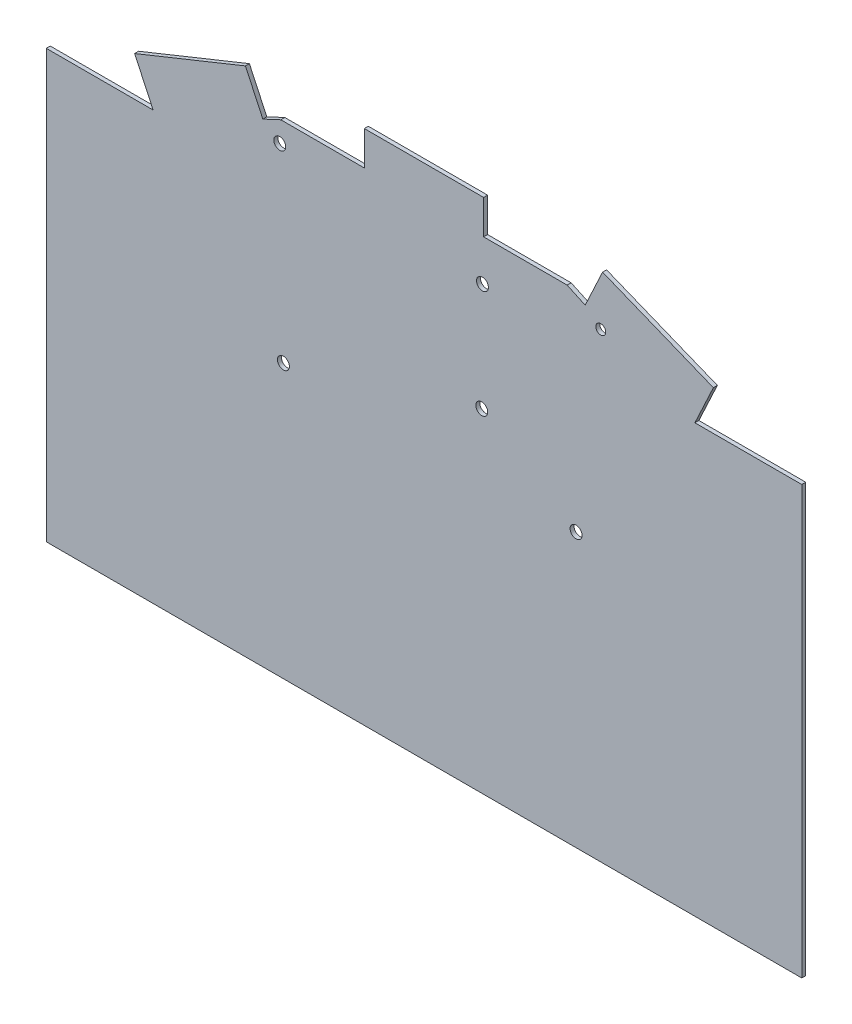
ISO-10303-21;
HEADER;
FILE_DESCRIPTION(('STEP AP214'),'2;1');
FILE_NAME('part.step','',(''),(''),'','','');
FILE_SCHEMA(('AUTOMOTIVE_DESIGN { 1 0 10303 214 1 1 1 1 }'));
ENDSEC;
DATA;
#1=APPLICATION_CONTEXT('core data for automotive mechanical design processes');
#2=APPLICATION_PROTOCOL_DEFINITION('international standard','automotive_design',2000,#1);
#3=PRODUCT_CONTEXT('',#1,'mechanical');
#4=PRODUCT('Part','Part','',(#3));
#5=PRODUCT_RELATED_PRODUCT_CATEGORY('part','',(#4));
#6=PRODUCT_DEFINITION_FORMATION('','',#4);
#7=PRODUCT_DEFINITION_CONTEXT('part definition',#1,'design');
#8=PRODUCT_DEFINITION('design','',#6,#7);
#9=PRODUCT_DEFINITION_SHAPE('','',#8);
#10=(LENGTH_UNIT() NAMED_UNIT(*) SI_UNIT(.MILLI.,.METRE.));
#11=(NAMED_UNIT(*) PLANE_ANGLE_UNIT() SI_UNIT($,.RADIAN.));
#12=(NAMED_UNIT(*) SI_UNIT($,.STERADIAN.) SOLID_ANGLE_UNIT());
#13=UNCERTAINTY_MEASURE_WITH_UNIT(LENGTH_MEASURE(1.E-05),#10,'distance_accuracy_value','');
#14=(GEOMETRIC_REPRESENTATION_CONTEXT(3) GLOBAL_UNCERTAINTY_ASSIGNED_CONTEXT((#13)) GLOBAL_UNIT_ASSIGNED_CONTEXT((#10,
#11,#12)) REPRESENTATION_CONTEXT('',''));
#15=CARTESIAN_POINT('',(0.,0.,0.));
#16=DIRECTION('',(0.,0.,1.));
#17=DIRECTION('',(1.,0.,0.));
#18=AXIS2_PLACEMENT_3D('',#15,#16,#17);
#19=CARTESIAN_POINT('',(-95.,-65.,1.));
#20=DIRECTION('',(-1.,0.,0.));
#21=DIRECTION('',(0.,0.,1.));
#22=AXIS2_PLACEMENT_3D('',#19,#20,#21);
#23=PLANE('',#22);
#24=DIRECTION('',(0.,0.,-1.));
#25=VECTOR('',#24,1.);
#26=CARTESIAN_POINT('',(-95.,42.4822262867314,1.001));
#27=LINE('',#26,#25);
#28=CARTESIAN_POINT('',(-95.,42.4822262867314,1.));
#29=VERTEX_POINT('',#28);
#30=CARTESIAN_POINT('',(-95.,42.4822262867314,0.));
#31=VERTEX_POINT('',#30);
#32=EDGE_CURVE('E194',#29,#31,#27,.T.);
#33=ORIENTED_EDGE('',*,*,#32,.T.);
#34=DIRECTION('',(0.,1.,0.));
#35=VECTOR('',#34,1.);
#36=CARTESIAN_POINT('',(-95.,-65.,0.));
#37=LINE('',#36,#35);
#38=CARTESIAN_POINT('',(-95.,-65.,0.));
#39=VERTEX_POINT('',#38);
#40=EDGE_CURVE('E234',#39,#31,#37,.T.);
#41=ORIENTED_EDGE('',*,*,#40,.F.);
#42=DIRECTION('',(0.,0.,-1.));
#43=VECTOR('',#42,1.);
#44=CARTESIAN_POINT('',(-95.,-65.,1.));
#45=LINE('',#44,#43);
#46=CARTESIAN_POINT('',(-95.,-65.,1.));
#47=VERTEX_POINT('',#46);
#48=EDGE_CURVE('E11',#47,#39,#45,.T.);
#49=ORIENTED_EDGE('',*,*,#48,.F.);
#50=DIRECTION('',(0.,1.,0.));
#51=VECTOR('',#50,1.);
#52=CARTESIAN_POINT('',(-95.,-65.,1.));
#53=LINE('',#52,#51);
#54=EDGE_CURVE('E235',#47,#29,#53,.T.);
#55=ORIENTED_EDGE('',*,*,#54,.T.);
#56=EDGE_LOOP('',(#33,#41,#49,#55));
#57=FACE_BOUND('',#56,.T.);
#58=ADVANCED_FACE('F37',(#57),#23,.T.);
#59=CARTESIAN_POINT('',(-95.,-65.,1.));
#60=DIRECTION('',(0.,1.,0.));
#61=DIRECTION('',(0.,0.,1.));
#62=AXIS2_PLACEMENT_3D('',#59,#60,#61);
#63=PLANE('',#62);
#64=DIRECTION('',(1.,0.,0.));
#65=VECTOR('',#64,1.);
#66=CARTESIAN_POINT('',(-95.,-65.,0.));
#67=LINE('',#66,#65);
#68=CARTESIAN_POINT('',(95.,-65.,0.));
#69=VERTEX_POINT('',#68);
#70=EDGE_CURVE('E239',#39,#69,#67,.T.);
#71=ORIENTED_EDGE('',*,*,#70,.T.);
#72=DIRECTION('',(0.,0.,-1.));
#73=VECTOR('',#72,1.);
#74=CARTESIAN_POINT('',(95.,-65.,1.));
#75=LINE('',#74,#73);
#76=CARTESIAN_POINT('',(95.,-65.,1.));
#77=VERTEX_POINT('',#76);
#78=EDGE_CURVE('E40',#77,#69,#75,.T.);
#79=ORIENTED_EDGE('',*,*,#78,.F.);
#80=DIRECTION('',(1.,0.,0.));
#81=VECTOR('',#80,1.);
#82=CARTESIAN_POINT('',(-95.,-65.,1.));
#83=LINE('',#82,#81);
#84=EDGE_CURVE('E244',#47,#77,#83,.T.);
#85=ORIENTED_EDGE('',*,*,#84,.F.);
#86=ORIENTED_EDGE('',*,*,#48,.T.);
#87=EDGE_LOOP('',(#71,#79,#85,#86));
#88=FACE_BOUND('',#87,.T.);
#89=ADVANCED_FACE('F258',(#88),#63,.F.);
#90=CARTESIAN_POINT('',(95.,-65.,1.));
#91=DIRECTION('',(-1.,0.,0.));
#92=DIRECTION('',(0.,0.,1.));
#93=AXIS2_PLACEMENT_3D('',#90,#91,#92);
#94=PLANE('',#93);
#95=DIRECTION('',(0.,1.,0.));
#96=VECTOR('',#95,1.);
#97=CARTESIAN_POINT('',(95.,-65.,0.));
#98=LINE('',#97,#96);
#99=CARTESIAN_POINT('',(95.,42.4822262867326,0.));
#100=VERTEX_POINT('',#99);
#101=EDGE_CURVE('E251',#69,#100,#98,.T.);
#102=ORIENTED_EDGE('',*,*,#101,.T.);
#103=DIRECTION('',(0.,0.,-1.));
#104=VECTOR('',#103,1.);
#105=CARTESIAN_POINT('',(95.,42.4822262867326,1.001));
#106=LINE('',#105,#104);
#107=CARTESIAN_POINT('',(95.,42.4822262867326,1.));
#108=VERTEX_POINT('',#107);
#109=EDGE_CURVE('E275',#108,#100,#106,.T.);
#110=ORIENTED_EDGE('',*,*,#109,.F.);
#111=DIRECTION('',(0.,1.,0.));
#112=VECTOR('',#111,1.);
#113=CARTESIAN_POINT('',(95.,-65.,1.));
#114=LINE('',#113,#112);
#115=EDGE_CURVE('E242',#77,#108,#114,.T.);
#116=ORIENTED_EDGE('',*,*,#115,.F.);
#117=ORIENTED_EDGE('',*,*,#78,.T.);
#118=EDGE_LOOP('',(#102,#110,#116,#117));
#119=FACE_BOUND('',#118,.T.);
#120=ADVANCED_FACE('F265',(#119),#94,.F.);
#121=CARTESIAN_POINT('',(-95.,65.,1.));
#122=DIRECTION('',(0.,1.,0.));
#123=DIRECTION('',(0.,0.,1.));
#124=AXIS2_PLACEMENT_3D('',#121,#122,#123);
#125=PLANE('',#124);
#126=DIRECTION('',(0.,0.,-1.));
#127=VECTOR('',#126,1.);
#128=CARTESIAN_POINT('',(15.0000000000007,65.,1.001));
#129=LINE('',#128,#127);
#130=CARTESIAN_POINT('',(15.0000000000007,65.,1.));
#131=VERTEX_POINT('',#130);
#132=CARTESIAN_POINT('',(15.0000000000007,65.,0.));
#133=VERTEX_POINT('',#132);
#134=EDGE_CURVE('E303',#131,#133,#129,.T.);
#135=ORIENTED_EDGE('',*,*,#134,.T.);
#136=DIRECTION('',(1.,0.,0.));
#137=VECTOR('',#136,1.);
#138=CARTESIAN_POINT('',(-95.,65.,0.));
#139=LINE('',#138,#137);
#140=CARTESIAN_POINT('',(-15.0115000880487,65.,0.));
#141=VERTEX_POINT('',#140);
#142=EDGE_CURVE('E248',#141,#133,#139,.T.);
#143=ORIENTED_EDGE('',*,*,#142,.F.);
#144=DIRECTION('',(0.,0.,-1.));
#145=VECTOR('',#144,1.);
#146=CARTESIAN_POINT('',(-15.0115000880487,65.,1.001));
#147=LINE('',#146,#145);
#148=CARTESIAN_POINT('',(-15.0115000880487,65.,1.));
#149=VERTEX_POINT('',#148);
#150=EDGE_CURVE('E335',#149,#141,#147,.T.);
#151=ORIENTED_EDGE('',*,*,#150,.F.);
#152=DIRECTION('',(1.,0.,0.));
#153=VECTOR('',#152,1.);
#154=CARTESIAN_POINT('',(-95.,65.,1.));
#155=LINE('',#154,#153);
#156=EDGE_CURVE('E238',#149,#131,#155,.T.);
#157=ORIENTED_EDGE('',*,*,#156,.T.);
#158=EDGE_LOOP('',(#135,#143,#151,#157));
#159=FACE_BOUND('',#158,.T.);
#160=ADVANCED_FACE('F383',(#159),#125,.T.);
#161=CARTESIAN_POINT('',(0.,0.,1.));
#162=DIRECTION('',(0.,0.,-1.));
#163=DIRECTION('',(-1.,0.,0.));
#164=AXIS2_PLACEMENT_3D('',#161,#162,#163);
#165=PLANE('',#164);
#166=ORIENTED_EDGE('',*,*,#115,.T.);
#167=DIRECTION('',(1.,0.,0.));
#168=VECTOR('',#167,1.);
#169=CARTESIAN_POINT('',(95.0307413305068,42.4822262867326,1.));
#170=LINE('',#169,#168);
#171=CARTESIAN_POINT('',(68.1231884542343,42.4822262867325,1.));
#172=VERTEX_POINT('',#171);
#173=EDGE_CURVE('E180',#172,#108,#170,.T.);
#174=ORIENTED_EDGE('',*,*,#173,.F.);
#175=DIRECTION('',(-0.422618261740693,-0.906307787036653,0.));
#176=VECTOR('',#175,1.);
#177=CARTESIAN_POINT('',(68.1231884542343,42.4822262867325,1.));
#178=LINE('',#177,#176);
#179=CARTESIAN_POINT('',(72.7745534501897,52.4571107103748,1.));
#180=VERTEX_POINT('',#179);
#181=EDGE_CURVE('E162',#180,#172,#178,.T.);
#182=ORIENTED_EDGE('',*,*,#181,.F.);
#183=DIRECTION('',(0.927510394634945,-0.373797362007986,0.));
#184=VECTOR('',#183,1.);
#185=CARTESIAN_POINT('',(95.,43.5,1.));
#186=LINE('',#185,#184);
#187=CARTESIAN_POINT('',(44.9097707170079,63.6869387951463,1.));
#188=VERTEX_POINT('',#187);
#189=EDGE_CURVE('E179',#188,#180,#186,.T.);
#190=ORIENTED_EDGE('',*,*,#189,.F.);
#191=DIRECTION('',(0.422618261740699,0.90630778703665,0.));
#192=VECTOR('',#191,1.);
#193=CARTESIAN_POINT('',(44.9097707170079,63.6869387951463,1.));
#194=LINE('',#193,#192);
#195=CARTESIAN_POINT('',(40.5315389351839,54.2977904394299,1.));
#196=VERTEX_POINT('',#195);
#197=EDGE_CURVE('E280',#196,#188,#194,.T.);
#198=ORIENTED_EDGE('',*,*,#197,.F.);
#199=DIRECTION('',(0.90630778703665,-0.422618261740699,0.));
#200=VECTOR('',#199,1.);
#201=CARTESIAN_POINT('',(40.5315389351839,54.2977904394299,1.));
#202=LINE('',#201,#200);
#203=CARTESIAN_POINT('',(36.0000000000007,56.4108817481334,1.));
#204=VERTEX_POINT('',#203);
#205=EDGE_CURVE('E282',#204,#196,#202,.T.);
#206=ORIENTED_EDGE('',*,*,#205,.F.);
#207=DIRECTION('',(1.,0.,0.));
#208=VECTOR('',#207,1.);
#209=CARTESIAN_POINT('',(36.0000000000007,56.4108817481334,1.));
#210=LINE('',#209,#208);
#211=CARTESIAN_POINT('',(15.0000000000008,56.4108817481331,1.));
#212=VERTEX_POINT('',#211);
#213=EDGE_CURVE('E286',#212,#204,#210,.T.);
#214=ORIENTED_EDGE('',*,*,#213,.F.);
#215=DIRECTION('',(0.,-1.,0.));
#216=VECTOR('',#215,1.);
#217=CARTESIAN_POINT('',(15.0000000000008,56.4108817481331,1.));
#218=LINE('',#217,#216);
#219=EDGE_CURVE('E289',#131,#212,#218,.T.);
#220=ORIENTED_EDGE('',*,*,#219,.F.);
#221=ORIENTED_EDGE('',*,*,#156,.F.);
#222=DIRECTION('',(-0.00133891249418699,0.999999103656265,0.));
#223=VECTOR('',#222,1.);
#224=CARTESIAN_POINT('',(-15.0115000880487,65.,1.));
#225=LINE('',#224,#223);
#226=CARTESIAN_POINT('',(-14.9999999999992,56.4108817481329,1.));
#227=VERTEX_POINT('',#226);
#228=EDGE_CURVE('E320',#227,#149,#225,.T.);
#229=ORIENTED_EDGE('',*,*,#228,.F.);
#230=DIRECTION('',(1.,0.,0.));
#231=VECTOR('',#230,1.);
#232=CARTESIAN_POINT('',(-14.9999999999992,56.4108817481329,1.));
#233=LINE('',#232,#231);
#234=CARTESIAN_POINT('',(-35.9999999999992,56.4108817481328,1.));
#235=VERTEX_POINT('',#234);
#236=EDGE_CURVE('E316',#235,#227,#233,.T.);
#237=ORIENTED_EDGE('',*,*,#236,.F.);
#238=DIRECTION('',(0.906307787036646,0.422618261740708,0.));
#239=VECTOR('',#238,1.);
#240=CARTESIAN_POINT('',(-35.9999999999992,56.4108817481328,1.));
#241=LINE('',#240,#239);
#242=CARTESIAN_POINT('',(-40.5315389351824,54.2977904394292,1.));
#243=VERTEX_POINT('',#242);
#244=EDGE_CURVE('E283',#243,#235,#241,.T.);
#245=ORIENTED_EDGE('',*,*,#244,.F.);
#246=DIRECTION('',(0.422618261740706,-0.906307787036647,0.));
#247=VECTOR('',#246,1.);
#248=CARTESIAN_POINT('',(-40.5315389351824,54.2977904394292,1.));
#249=LINE('',#248,#247);
#250=CARTESIAN_POINT('',(-44.909770717007,63.6869387951467,1.));
#251=VERTEX_POINT('',#250);
#252=EDGE_CURVE('E313',#251,#243,#249,.T.);
#253=ORIENTED_EDGE('',*,*,#252,.F.);
#254=DIRECTION('',(0.927510394634945,0.373797362007986,0.));
#255=VECTOR('',#254,1.);
#256=CARTESIAN_POINT('',(-95.,43.5,1.));
#257=LINE('',#256,#255);
#258=CARTESIAN_POINT('',(-72.7745534501897,52.4571107103748,1.));
#259=VERTEX_POINT('',#258);
#260=EDGE_CURVE('E181',#259,#251,#257,.T.);
#261=ORIENTED_EDGE('',*,*,#260,.F.);
#262=DIRECTION('',(-0.422618261740708,0.906307787036646,0.));
#263=VECTOR('',#262,1.);
#264=CARTESIAN_POINT('',(-72.7745534501897,52.4571107103748,1.));
#265=LINE('',#264,#263);
#266=CARTESIAN_POINT('',(-68.1231884542335,42.4822262867311,1.));
#267=VERTEX_POINT('',#266);
#268=EDGE_CURVE('E59',#267,#259,#265,.T.);
#269=ORIENTED_EDGE('',*,*,#268,.F.);
#270=DIRECTION('',(1.,0.,0.));
#271=VECTOR('',#270,1.);
#272=CARTESIAN_POINT('',(-68.1231884542335,42.4822262867311,1.));
#273=LINE('',#272,#271);
#274=EDGE_CURVE('E345',#29,#267,#273,.T.);
#275=ORIENTED_EDGE('',*,*,#274,.F.);
#276=ORIENTED_EDGE('',*,*,#54,.F.);
#277=ORIENTED_EDGE('',*,*,#84,.T.);
#278=EDGE_LOOP('',(#166,#174,#182,#190,#198,#206,#214,#220,#221,#229,#237,#245,#253,#261,#269,
#275,#276,#277));
#279=FACE_BOUND('',#278,.T.);
#280=CARTESIAN_POINT('',(44.45,51.,0.999999999999999));
#281=DIRECTION('',(0.,0.,-1.));
#282=DIRECTION('',(-1.,0.,0.));
#283=AXIS2_PLACEMENT_3D('',#280,#281,#282);
#284=CIRCLE('',#283,1.25);
#285=CARTESIAN_POINT('',(43.2,51.,0.999999999999999));
#286=VERTEX_POINT('',#285);
#287=EDGE_CURVE('E231',#286,#286,#284,.T.);
#288=ORIENTED_EDGE('',*,*,#287,.T.);
#289=EDGE_LOOP('',(#288));
#290=FACE_BOUND('',#289,.T.);
#291=CARTESIAN_POINT('',(-36.270123649233,51.1277147960607,0.999999999999999));
#292=DIRECTION('',(0.,0.,-1.));
#293=DIRECTION('',(-1.,0.,0.));
#294=AXIS2_PLACEMENT_3D('',#291,#292,#293);
#295=CIRCLE('',#294,1.5);
#296=CARTESIAN_POINT('',(-37.770123649233,51.1277147960607,0.999999999999999));
#297=VERTEX_POINT('',#296);
#298=EDGE_CURVE('E228',#297,#297,#295,.T.);
#299=ORIENTED_EDGE('',*,*,#298,.T.);
#300=EDGE_LOOP('',(#299));
#301=FACE_BOUND('',#300,.T.);
#302=CARTESIAN_POINT('',(14.524931806913,18.7475198637513,0.999999999999999));
#303=DIRECTION('',(0.,0.,-1.));
#304=DIRECTION('',(-1.,0.,0.));
#305=AXIS2_PLACEMENT_3D('',#302,#303,#304);
#306=CIRCLE('',#305,1.5);
#307=CARTESIAN_POINT('',(13.024931806913,18.7475198637513,0.999999999999999));
#308=VERTEX_POINT('',#307);
#309=EDGE_CURVE('E225',#308,#308,#306,.T.);
#310=ORIENTED_EDGE('',*,*,#309,.T.);
#311=EDGE_LOOP('',(#310));
#312=FACE_BOUND('',#311,.T.);
#313=CARTESIAN_POINT('',(14.7003512590455,45.9873295721862,0.999999999999999));
#314=DIRECTION('',(0.,0.,-1.));
#315=DIRECTION('',(-1.,0.,0.));
#316=AXIS2_PLACEMENT_3D('',#313,#314,#315);
#317=CIRCLE('',#316,1.5);
#318=CARTESIAN_POINT('',(13.2003512590455,45.9873295721862,0.999999999999999));
#319=VERTEX_POINT('',#318);
#320=EDGE_CURVE('E222',#319,#319,#317,.T.);
#321=ORIENTED_EDGE('',*,*,#320,.T.);
#322=EDGE_LOOP('',(#321));
#323=FACE_BOUND('',#322,.T.);
#324=CARTESIAN_POINT('',(38.24,3.75000000000002,0.999999999999999));
#325=DIRECTION('',(0.,0.,-1.));
#326=DIRECTION('',(-1.,0.,0.));
#327=AXIS2_PLACEMENT_3D('',#324,#325,#326);
#328=CIRCLE('',#327,1.5);
#329=CARTESIAN_POINT('',(36.74,3.75000000000002,0.999999999999999));
#330=VERTEX_POINT('',#329);
#331=EDGE_CURVE('E219',#330,#330,#328,.T.);
#332=ORIENTED_EDGE('',*,*,#331,.T.);
#333=EDGE_LOOP('',(#332));
#334=FACE_BOUND('',#333,.T.);
#335=CARTESIAN_POINT('',(-35.3574724539974,3.74671870198268,0.999999999999999));
#336=DIRECTION('',(0.,0.,-1.));
#337=DIRECTION('',(-1.,0.,0.));
#338=AXIS2_PLACEMENT_3D('',#335,#336,#337);
#339=CIRCLE('',#338,1.5);
#340=CARTESIAN_POINT('',(-36.8574724539974,3.74671870198268,0.999999999999999));
#341=VERTEX_POINT('',#340);
#342=EDGE_CURVE('E216',#341,#341,#339,.T.);
#343=ORIENTED_EDGE('',*,*,#342,.T.);
#344=EDGE_LOOP('',(#343));
#345=FACE_BOUND('',#344,.T.);
#346=ADVANCED_FACE('F176',(#279,#290,#301,#312,#323,#334,#345),#165,.F.);
#347=CARTESIAN_POINT('',(0.,0.,0.));
#348=DIRECTION('',(0.,0.,-1.));
#349=DIRECTION('',(-1.,0.,0.));
#350=AXIS2_PLACEMENT_3D('',#347,#348,#349);
#351=PLANE('',#350);
#352=DIRECTION('',(-1.,0.,0.));
#353=VECTOR('',#352,1.);
#354=CARTESIAN_POINT('',(95.0307413305068,42.4822262867326,0.));
#355=LINE('',#354,#353);
#356=CARTESIAN_POINT('',(68.1231884542343,42.4822262867325,0.));
#357=VERTEX_POINT('',#356);
#358=EDGE_CURVE('E271',#100,#357,#355,.T.);
#359=ORIENTED_EDGE('',*,*,#358,.F.);
#360=ORIENTED_EDGE('',*,*,#101,.F.);
#361=ORIENTED_EDGE('',*,*,#70,.F.);
#362=ORIENTED_EDGE('',*,*,#40,.T.);
#363=DIRECTION('',(-1.,0.,0.));
#364=VECTOR('',#363,1.);
#365=CARTESIAN_POINT('',(-68.1231884542335,42.4822262867311,0.));
#366=LINE('',#365,#364);
#367=CARTESIAN_POINT('',(-68.1231884542335,42.4822262867311,0.));
#368=VERTEX_POINT('',#367);
#369=EDGE_CURVE('E348',#368,#31,#366,.T.);
#370=ORIENTED_EDGE('',*,*,#369,.F.);
#371=DIRECTION('',(0.422618261740708,-0.906307787036646,0.));
#372=VECTOR('',#371,1.);
#373=CARTESIAN_POINT('',(-72.7745534501897,52.4571107103748,0.));
#374=LINE('',#373,#372);
#375=CARTESIAN_POINT('',(-72.7745534501897,52.4571107103748,0.));
#376=VERTEX_POINT('',#375);
#377=EDGE_CURVE('E350',#376,#368,#374,.T.);
#378=ORIENTED_EDGE('',*,*,#377,.F.);
#379=DIRECTION('',(-0.927510394634945,-0.373797362007986,0.));
#380=VECTOR('',#379,1.);
#381=CARTESIAN_POINT('',(-95.,43.5,0.));
#382=LINE('',#381,#380);
#383=CARTESIAN_POINT('',(-44.909770717007,63.6869387951467,0.));
#384=VERTEX_POINT('',#383);
#385=EDGE_CURVE('E187',#384,#376,#382,.T.);
#386=ORIENTED_EDGE('',*,*,#385,.F.);
#387=DIRECTION('',(-0.422618261740706,0.906307787036647,0.));
#388=VECTOR('',#387,1.);
#389=CARTESIAN_POINT('',(-40.5315389351824,54.2977904394292,0.));
#390=LINE('',#389,#388);
#391=CARTESIAN_POINT('',(-40.5315389351824,54.2977904394292,0.));
#392=VERTEX_POINT('',#391);
#393=EDGE_CURVE('E51',#392,#384,#390,.T.);
#394=ORIENTED_EDGE('',*,*,#393,.F.);
#395=DIRECTION('',(-0.906307787036646,-0.422618261740708,0.));
#396=VECTOR('',#395,1.);
#397=CARTESIAN_POINT('',(-35.9999999999992,56.4108817481328,0.));
#398=LINE('',#397,#396);
#399=CARTESIAN_POINT('',(-35.9999999999992,56.4108817481328,0.));
#400=VERTEX_POINT('',#399);
#401=EDGE_CURVE('E325',#400,#392,#398,.T.);
#402=ORIENTED_EDGE('',*,*,#401,.F.);
#403=DIRECTION('',(-1.,0.,0.));
#404=VECTOR('',#403,1.);
#405=CARTESIAN_POINT('',(-14.9999999999992,56.4108817481329,0.));
#406=LINE('',#405,#404);
#407=CARTESIAN_POINT('',(-14.9999999999992,56.4108817481329,0.));
#408=VERTEX_POINT('',#407);
#409=EDGE_CURVE('E322',#408,#400,#406,.T.);
#410=ORIENTED_EDGE('',*,*,#409,.F.);
#411=DIRECTION('',(0.00133891249418699,-0.999999103656265,0.));
#412=VECTOR('',#411,1.);
#413=CARTESIAN_POINT('',(-15.0115000880487,65.,0.));
#414=LINE('',#413,#412);
#415=EDGE_CURVE('E329',#141,#408,#414,.T.);
#416=ORIENTED_EDGE('',*,*,#415,.F.);
#417=ORIENTED_EDGE('',*,*,#142,.T.);
#418=DIRECTION('',(0.,1.,0.));
#419=VECTOR('',#418,1.);
#420=CARTESIAN_POINT('',(15.0000000000008,56.4108817481331,0.));
#421=LINE('',#420,#419);
#422=CARTESIAN_POINT('',(15.0000000000008,56.4108817481331,0.));
#423=VERTEX_POINT('',#422);
#424=EDGE_CURVE('E292',#423,#133,#421,.T.);
#425=ORIENTED_EDGE('',*,*,#424,.F.);
#426=DIRECTION('',(-1.,0.,0.));
#427=VECTOR('',#426,1.);
#428=CARTESIAN_POINT('',(36.0000000000007,56.4108817481334,0.));
#429=LINE('',#428,#427);
#430=CARTESIAN_POINT('',(36.0000000000007,56.4108817481334,0.));
#431=VERTEX_POINT('',#430);
#432=EDGE_CURVE('E300',#431,#423,#429,.T.);
#433=ORIENTED_EDGE('',*,*,#432,.F.);
#434=DIRECTION('',(-0.90630778703665,0.422618261740699,0.));
#435=VECTOR('',#434,1.);
#436=CARTESIAN_POINT('',(40.5315389351839,54.2977904394299,0.));
#437=LINE('',#436,#435);
#438=CARTESIAN_POINT('',(40.5315389351839,54.2977904394299,0.));
#439=VERTEX_POINT('',#438);
#440=EDGE_CURVE('E297',#439,#431,#437,.T.);
#441=ORIENTED_EDGE('',*,*,#440,.F.);
#442=DIRECTION('',(-0.422618261740699,-0.90630778703665,0.));
#443=VECTOR('',#442,1.);
#444=CARTESIAN_POINT('',(44.9097707170079,63.6869387951463,0.));
#445=LINE('',#444,#443);
#446=CARTESIAN_POINT('',(44.9097707170079,63.6869387951463,0.));
#447=VERTEX_POINT('',#446);
#448=EDGE_CURVE('E294',#447,#439,#445,.T.);
#449=ORIENTED_EDGE('',*,*,#448,.F.);
#450=DIRECTION('',(-0.927510394634945,0.373797362007986,0.));
#451=VECTOR('',#450,1.);
#452=CARTESIAN_POINT('',(95.,43.5,0.));
#453=LINE('',#452,#451);
#454=CARTESIAN_POINT('',(72.7745534501897,52.4571107103748,0.));
#455=VERTEX_POINT('',#454);
#456=EDGE_CURVE('E186',#455,#447,#453,.T.);
#457=ORIENTED_EDGE('',*,*,#456,.F.);
#458=DIRECTION('',(0.422618261740693,0.906307787036653,0.));
#459=VECTOR('',#458,1.);
#460=CARTESIAN_POINT('',(68.1231884542343,42.4822262867325,0.));
#461=LINE('',#460,#459);
#462=EDGE_CURVE('E165',#357,#455,#461,.T.);
#463=ORIENTED_EDGE('',*,*,#462,.F.);
#464=EDGE_LOOP('',(#359,#360,#361,#362,#370,#378,#386,#394,#402,#410,#416,#417,#425,#433,#441,
#449,#457,#463));
#465=FACE_BOUND('',#464,.T.);
#466=CARTESIAN_POINT('',(44.45,51.,0.));
#467=DIRECTION('',(0.,0.,-1.));
#468=DIRECTION('',(-1.,0.,0.));
#469=AXIS2_PLACEMENT_3D('',#466,#467,#468);
#470=CIRCLE('',#469,1.25);
#471=CARTESIAN_POINT('',(43.2,51.,0.));
#472=VERTEX_POINT('',#471);
#473=EDGE_CURVE('E189',#472,#472,#470,.T.);
#474=ORIENTED_EDGE('',*,*,#473,.F.);
#475=EDGE_LOOP('',(#474));
#476=FACE_BOUND('',#475,.T.);
#477=CARTESIAN_POINT('',(-36.270123649233,51.1277147960607,0.));
#478=DIRECTION('',(0.,0.,-1.));
#479=DIRECTION('',(-1.,0.,0.));
#480=AXIS2_PLACEMENT_3D('',#477,#478,#479);
#481=CIRCLE('',#480,1.5);
#482=CARTESIAN_POINT('',(-37.770123649233,51.1277147960607,0.));
#483=VERTEX_POINT('',#482);
#484=EDGE_CURVE('E206',#483,#483,#481,.T.);
#485=ORIENTED_EDGE('',*,*,#484,.F.);
#486=EDGE_LOOP('',(#485));
#487=FACE_BOUND('',#486,.T.);
#488=CARTESIAN_POINT('',(14.524931806913,18.7475198637513,0.));
#489=DIRECTION('',(0.,0.,-1.));
#490=DIRECTION('',(-1.,0.,0.));
#491=AXIS2_PLACEMENT_3D('',#488,#489,#490);
#492=CIRCLE('',#491,1.5);
#493=CARTESIAN_POINT('',(13.024931806913,18.7475198637513,0.));
#494=VERTEX_POINT('',#493);
#495=EDGE_CURVE('E202',#494,#494,#492,.T.);
#496=ORIENTED_EDGE('',*,*,#495,.F.);
#497=EDGE_LOOP('',(#496));
#498=FACE_BOUND('',#497,.T.);
#499=CARTESIAN_POINT('',(14.7003512590455,45.9873295721862,0.));
#500=DIRECTION('',(0.,0.,-1.));
#501=DIRECTION('',(-1.,0.,0.));
#502=AXIS2_PLACEMENT_3D('',#499,#500,#501);
#503=CIRCLE('',#502,1.5);
#504=CARTESIAN_POINT('',(13.2003512590455,45.9873295721862,0.));
#505=VERTEX_POINT('',#504);
#506=EDGE_CURVE('E199',#505,#505,#503,.T.);
#507=ORIENTED_EDGE('',*,*,#506,.F.);
#508=EDGE_LOOP('',(#507));
#509=FACE_BOUND('',#508,.T.);
#510=CARTESIAN_POINT('',(38.24,3.75000000000002,0.));
#511=DIRECTION('',(0.,0.,-1.));
#512=DIRECTION('',(-1.,0.,0.));
#513=AXIS2_PLACEMENT_3D('',#510,#511,#512);
#514=CIRCLE('',#513,1.5);
#515=CARTESIAN_POINT('',(36.74,3.75000000000002,0.));
#516=VERTEX_POINT('',#515);
#517=EDGE_CURVE('E203',#516,#516,#514,.T.);
#518=ORIENTED_EDGE('',*,*,#517,.F.);
#519=EDGE_LOOP('',(#518));
#520=FACE_BOUND('',#519,.T.);
#521=CARTESIAN_POINT('',(-35.3574724539974,3.74671870198268,0.));
#522=DIRECTION('',(0.,0.,-1.));
#523=DIRECTION('',(-1.,0.,0.));
#524=AXIS2_PLACEMENT_3D('',#521,#522,#523);
#525=CIRCLE('',#524,1.5);
#526=CARTESIAN_POINT('',(-36.8574724539974,3.74671870198268,0.));
#527=VERTEX_POINT('',#526);
#528=EDGE_CURVE('E209',#527,#527,#525,.T.);
#529=ORIENTED_EDGE('',*,*,#528,.F.);
#530=EDGE_LOOP('',(#529));
#531=FACE_BOUND('',#530,.T.);
#532=ADVANCED_FACE('F268',(#465,#476,#487,#498,#509,#520,#531),#351,.T.);
#533=CARTESIAN_POINT('',(-35.3574724539974,3.74671870198268,10.));
#534=DIRECTION('',(0.,0.,-1.));
#535=DIRECTION('',(-1.,0.,0.));
#536=AXIS2_PLACEMENT_3D('',#533,#534,#535);
#537=CYLINDRICAL_SURFACE('',#536,1.5);
#538=ORIENTED_EDGE('',*,*,#528,.T.);
#539=EDGE_LOOP('',(#538));
#540=FACE_BOUND('',#539,.T.);
#541=ORIENTED_EDGE('',*,*,#342,.F.);
#542=EDGE_LOOP('',(#541));
#543=FACE_BOUND('',#542,.T.);
#544=ADVANCED_FACE('F464',(#540,#543),#537,.F.);
#545=CARTESIAN_POINT('',(38.24,3.75000000000002,10.));
#546=DIRECTION('',(0.,0.,-1.));
#547=DIRECTION('',(-1.,0.,0.));
#548=AXIS2_PLACEMENT_3D('',#545,#546,#547);
#549=CYLINDRICAL_SURFACE('',#548,1.5);
#550=ORIENTED_EDGE('',*,*,#517,.T.);
#551=EDGE_LOOP('',(#550));
#552=FACE_BOUND('',#551,.T.);
#553=ORIENTED_EDGE('',*,*,#331,.F.);
#554=EDGE_LOOP('',(#553));
#555=FACE_BOUND('',#554,.T.);
#556=ADVANCED_FACE('F460',(#552,#555),#549,.F.);
#557=CARTESIAN_POINT('',(14.7003512590455,45.9873295721862,10.));
#558=DIRECTION('',(0.,0.,-1.));
#559=DIRECTION('',(-1.,0.,0.));
#560=AXIS2_PLACEMENT_3D('',#557,#558,#559);
#561=CYLINDRICAL_SURFACE('',#560,1.5);
#562=ORIENTED_EDGE('',*,*,#506,.T.);
#563=EDGE_LOOP('',(#562));
#564=FACE_BOUND('',#563,.T.);
#565=ORIENTED_EDGE('',*,*,#320,.F.);
#566=EDGE_LOOP('',(#565));
#567=FACE_BOUND('',#566,.T.);
#568=ADVANCED_FACE('F456',(#564,#567),#561,.F.);
#569=CARTESIAN_POINT('',(14.524931806913,18.7475198637513,10.));
#570=DIRECTION('',(0.,0.,-1.));
#571=DIRECTION('',(-1.,0.,0.));
#572=AXIS2_PLACEMENT_3D('',#569,#570,#571);
#573=CYLINDRICAL_SURFACE('',#572,1.5);
#574=ORIENTED_EDGE('',*,*,#495,.T.);
#575=EDGE_LOOP('',(#574));
#576=FACE_BOUND('',#575,.T.);
#577=ORIENTED_EDGE('',*,*,#309,.F.);
#578=EDGE_LOOP('',(#577));
#579=FACE_BOUND('',#578,.T.);
#580=ADVANCED_FACE('F459',(#576,#579),#573,.F.);
#581=CARTESIAN_POINT('',(-36.270123649233,51.1277147960607,10.));
#582=DIRECTION('',(0.,0.,-1.));
#583=DIRECTION('',(-1.,0.,0.));
#584=AXIS2_PLACEMENT_3D('',#581,#582,#583);
#585=CYLINDRICAL_SURFACE('',#584,1.5);
#586=ORIENTED_EDGE('',*,*,#484,.T.);
#587=EDGE_LOOP('',(#586));
#588=FACE_BOUND('',#587,.T.);
#589=ORIENTED_EDGE('',*,*,#298,.F.);
#590=EDGE_LOOP('',(#589));
#591=FACE_BOUND('',#590,.T.);
#592=ADVANCED_FACE('F452',(#588,#591),#585,.F.);
#593=CARTESIAN_POINT('',(44.45,51.,10.));
#594=DIRECTION('',(0.,0.,-1.));
#595=DIRECTION('',(-1.,0.,0.));
#596=AXIS2_PLACEMENT_3D('',#593,#594,#595);
#597=CYLINDRICAL_SURFACE('',#596,1.25);
#598=ORIENTED_EDGE('',*,*,#473,.T.);
#599=EDGE_LOOP('',(#598));
#600=FACE_BOUND('',#599,.T.);
#601=ORIENTED_EDGE('',*,*,#287,.F.);
#602=EDGE_LOOP('',(#601));
#603=FACE_BOUND('',#602,.T.);
#604=ADVANCED_FACE('F445',(#600,#603),#597,.F.);
#605=CARTESIAN_POINT('',(-95.,43.5,1.001));
#606=DIRECTION('',(0.373797362007986,-0.927510394634945,0.));
#607=DIRECTION('',(0.927510394634945,0.373797362007986,0.));
#608=AXIS2_PLACEMENT_3D('',#605,#606,#607);
#609=PLANE('',#608);
#610=ORIENTED_EDGE('',*,*,#260,.T.);
#611=DIRECTION('',(0.,0.,-1.));
#612=VECTOR('',#611,1.);
#613=CARTESIAN_POINT('',(-44.909770717007,63.6869387951467,1.001));
#614=LINE('',#613,#612);
#615=EDGE_CURVE('E337',#251,#384,#614,.T.);
#616=ORIENTED_EDGE('',*,*,#615,.T.);
#617=ORIENTED_EDGE('',*,*,#385,.T.);
#618=DIRECTION('',(0.,0.,-1.));
#619=VECTOR('',#618,1.);
#620=CARTESIAN_POINT('',(-72.7745534501897,52.4571107103748,1.001));
#621=LINE('',#620,#619);
#622=EDGE_CURVE('E353',#259,#376,#621,.T.);
#623=ORIENTED_EDGE('',*,*,#622,.F.);
#624=EDGE_LOOP('',(#610,#616,#617,#623));
#625=FACE_BOUND('',#624,.T.);
#626=ADVANCED_FACE('F442',(#625),#609,.F.);
#627=CARTESIAN_POINT('',(95.,43.5,1.001));
#628=DIRECTION('',(-0.373797362007986,-0.927510394634945,0.));
#629=DIRECTION('',(0.927510394634945,-0.373797362007986,0.));
#630=AXIS2_PLACEMENT_3D('',#627,#628,#629);
#631=PLANE('',#630);
#632=ORIENTED_EDGE('',*,*,#189,.T.);
#633=DIRECTION('',(0.,0.,-1.));
#634=VECTOR('',#633,1.);
#635=CARTESIAN_POINT('',(72.7745534501897,52.4571107103748,1.001));
#636=LINE('',#635,#634);
#637=EDGE_CURVE('E159',#180,#455,#636,.T.);
#638=ORIENTED_EDGE('',*,*,#637,.T.);
#639=ORIENTED_EDGE('',*,*,#456,.T.);
#640=DIRECTION('',(0.,0.,-1.));
#641=VECTOR('',#640,1.);
#642=CARTESIAN_POINT('',(44.9097707170079,63.6869387951463,1.001));
#643=LINE('',#642,#641);
#644=EDGE_CURVE('E185',#188,#447,#643,.T.);
#645=ORIENTED_EDGE('',*,*,#644,.F.);
#646=EDGE_LOOP('',(#632,#638,#639,#645));
#647=FACE_BOUND('',#646,.T.);
#648=ADVANCED_FACE('F184',(#647),#631,.F.);
#649=CARTESIAN_POINT('',(15.0000000000008,56.4108817481331,1.001));
#650=DIRECTION('',(-1.,0.,0.));
#651=DIRECTION('',(0.,-1.,0.));
#652=AXIS2_PLACEMENT_3D('',#649,#650,#651);
#653=PLANE('',#652);
#654=ORIENTED_EDGE('',*,*,#219,.T.);
#655=DIRECTION('',(0.,0.,-1.));
#656=VECTOR('',#655,1.);
#657=CARTESIAN_POINT('',(15.0000000000008,56.4108817481331,1.001));
#658=LINE('',#657,#656);
#659=EDGE_CURVE('E304',#212,#423,#658,.T.);
#660=ORIENTED_EDGE('',*,*,#659,.T.);
#661=ORIENTED_EDGE('',*,*,#424,.T.);
#662=ORIENTED_EDGE('',*,*,#134,.F.);
#663=EDGE_LOOP('',(#654,#660,#661,#662));
#664=FACE_BOUND('',#663,.T.);
#665=ADVANCED_FACE('F407',(#664),#653,.F.);
#666=CARTESIAN_POINT('',(36.0000000000007,56.4108817481334,1.001));
#667=DIRECTION('',(0.,-1.,0.));
#668=DIRECTION('',(1.,0.,0.));
#669=AXIS2_PLACEMENT_3D('',#666,#667,#668);
#670=PLANE('',#669);
#671=ORIENTED_EDGE('',*,*,#213,.T.);
#672=DIRECTION('',(0.,0.,-1.));
#673=VECTOR('',#672,1.);
#674=CARTESIAN_POINT('',(36.0000000000007,56.4108817481334,1.001));
#675=LINE('',#674,#673);
#676=EDGE_CURVE('E306',#204,#431,#675,.T.);
#677=ORIENTED_EDGE('',*,*,#676,.T.);
#678=ORIENTED_EDGE('',*,*,#432,.T.);
#679=ORIENTED_EDGE('',*,*,#659,.F.);
#680=EDGE_LOOP('',(#671,#677,#678,#679));
#681=FACE_BOUND('',#680,.T.);
#682=ADVANCED_FACE('F409',(#681),#670,.F.);
#683=CARTESIAN_POINT('',(40.5315389351839,54.2977904394299,1.001));
#684=DIRECTION('',(-0.422618261740699,-0.90630778703665,0.));
#685=DIRECTION('',(0.90630778703665,-0.422618261740699,0.));
#686=AXIS2_PLACEMENT_3D('',#683,#684,#685);
#687=PLANE('',#686);
#688=ORIENTED_EDGE('',*,*,#205,.T.);
#689=DIRECTION('',(0.,0.,-1.));
#690=VECTOR('',#689,1.);
#691=CARTESIAN_POINT('',(40.5315389351839,54.2977904394299,1.001));
#692=LINE('',#691,#690);
#693=EDGE_CURVE('E308',#196,#439,#692,.T.);
#694=ORIENTED_EDGE('',*,*,#693,.T.);
#695=ORIENTED_EDGE('',*,*,#440,.T.);
#696=ORIENTED_EDGE('',*,*,#676,.F.);
#697=EDGE_LOOP('',(#688,#694,#695,#696));
#698=FACE_BOUND('',#697,.T.);
#699=ADVANCED_FACE('F413',(#698),#687,.F.);
#700=CARTESIAN_POINT('',(44.9097707170079,63.6869387951463,1.001));
#701=DIRECTION('',(0.90630778703665,-0.422618261740699,0.));
#702=DIRECTION('',(0.422618261740699,0.90630778703665,0.));
#703=AXIS2_PLACEMENT_3D('',#700,#701,#702);
#704=PLANE('',#703);
#705=ORIENTED_EDGE('',*,*,#197,.T.);
#706=ORIENTED_EDGE('',*,*,#644,.T.);
#707=ORIENTED_EDGE('',*,*,#448,.T.);
#708=ORIENTED_EDGE('',*,*,#693,.F.);
#709=EDGE_LOOP('',(#705,#706,#707,#708));
#710=FACE_BOUND('',#709,.T.);
#711=ADVANCED_FACE('F415',(#710),#704,.F.);
#712=CARTESIAN_POINT('',(95.0307413305068,42.4822262867326,1.001));
#713=DIRECTION('',(0.,-1.,0.));
#714=DIRECTION('',(1.,0.,0.));
#715=AXIS2_PLACEMENT_3D('',#712,#713,#714);
#716=PLANE('',#715);
#717=ORIENTED_EDGE('',*,*,#109,.T.);
#718=ORIENTED_EDGE('',*,*,#358,.T.);
#719=DIRECTION('',(0.,0.,-1.));
#720=VECTOR('',#719,1.);
#721=CARTESIAN_POINT('',(68.1231884542343,42.4822262867325,1.001));
#722=LINE('',#721,#720);
#723=EDGE_CURVE('E170',#172,#357,#722,.T.);
#724=ORIENTED_EDGE('',*,*,#723,.F.);
#725=ORIENTED_EDGE('',*,*,#173,.T.);
#726=EDGE_LOOP('',(#717,#718,#724,#725));
#727=FACE_BOUND('',#726,.T.);
#728=ADVANCED_FACE('F417',(#727),#716,.F.);
#729=CARTESIAN_POINT('',(68.1231884542343,42.4822262867325,1.001));
#730=DIRECTION('',(-0.906307787036653,0.422618261740693,0.));
#731=DIRECTION('',(-0.422618261740693,-0.906307787036653,0.));
#732=AXIS2_PLACEMENT_3D('',#729,#730,#731);
#733=PLANE('',#732);
#734=ORIENTED_EDGE('',*,*,#181,.T.);
#735=ORIENTED_EDGE('',*,*,#723,.T.);
#736=ORIENTED_EDGE('',*,*,#462,.T.);
#737=ORIENTED_EDGE('',*,*,#637,.F.);
#738=EDGE_LOOP('',(#734,#735,#736,#737));
#739=FACE_BOUND('',#738,.T.);
#740=ADVANCED_FACE('F161',(#739),#733,.F.);
#741=CARTESIAN_POINT('',(-68.1231884542335,42.4822262867311,1.001));
#742=DIRECTION('',(0.,-1.,0.));
#743=DIRECTION('',(1.,0.,0.));
#744=AXIS2_PLACEMENT_3D('',#741,#742,#743);
#745=PLANE('',#744);
#746=ORIENTED_EDGE('',*,*,#274,.T.);
#747=DIRECTION('',(0.,0.,-1.));
#748=VECTOR('',#747,1.);
#749=CARTESIAN_POINT('',(-68.1231884542335,42.4822262867311,1.001));
#750=LINE('',#749,#748);
#751=EDGE_CURVE('E317',#267,#368,#750,.T.);
#752=ORIENTED_EDGE('',*,*,#751,.T.);
#753=ORIENTED_EDGE('',*,*,#369,.T.);
#754=ORIENTED_EDGE('',*,*,#32,.F.);
#755=EDGE_LOOP('',(#746,#752,#753,#754));
#756=FACE_BOUND('',#755,.T.);
#757=ADVANCED_FACE('F362',(#756),#745,.F.);
#758=CARTESIAN_POINT('',(-72.7745534501897,52.4571107103748,1.001));
#759=DIRECTION('',(0.906307787036646,0.422618261740708,0.));
#760=DIRECTION('',(-0.422618261740708,0.906307787036646,0.));
#761=AXIS2_PLACEMENT_3D('',#758,#759,#760);
#762=PLANE('',#761);
#763=ORIENTED_EDGE('',*,*,#268,.T.);
#764=ORIENTED_EDGE('',*,*,#622,.T.);
#765=ORIENTED_EDGE('',*,*,#377,.T.);
#766=ORIENTED_EDGE('',*,*,#751,.F.);
#767=EDGE_LOOP('',(#763,#764,#765,#766));
#768=FACE_BOUND('',#767,.T.);
#769=ADVANCED_FACE('F363',(#768),#762,.F.);
#770=CARTESIAN_POINT('',(-14.9999999999992,56.4108817481329,1.001));
#771=DIRECTION('',(0.,-1.,0.));
#772=DIRECTION('',(1.,0.,0.));
#773=AXIS2_PLACEMENT_3D('',#770,#771,#772);
#774=PLANE('',#773);
#775=ORIENTED_EDGE('',*,*,#236,.T.);
#776=DIRECTION('',(0.,0.,-1.));
#777=VECTOR('',#776,1.);
#778=CARTESIAN_POINT('',(-14.9999999999992,56.4108817481329,1.001));
#779=LINE('',#778,#777);
#780=EDGE_CURVE('E333',#227,#408,#779,.T.);
#781=ORIENTED_EDGE('',*,*,#780,.T.);
#782=ORIENTED_EDGE('',*,*,#409,.T.);
#783=DIRECTION('',(0.,0.,-1.));
#784=VECTOR('',#783,1.);
#785=CARTESIAN_POINT('',(-35.9999999999992,56.4108817481328,1.001));
#786=LINE('',#785,#784);
#787=EDGE_CURVE('E332',#235,#400,#786,.T.);
#788=ORIENTED_EDGE('',*,*,#787,.F.);
#789=EDGE_LOOP('',(#775,#781,#782,#788));
#790=FACE_BOUND('',#789,.T.);
#791=ADVANCED_FACE('F365',(#790),#774,.F.);
#792=CARTESIAN_POINT('',(-15.0115000880487,65.,1.001));
#793=DIRECTION('',(0.999999103656265,0.00133891249418699,0.));
#794=DIRECTION('',(-0.00133891249418699,0.999999103656265,0.));
#795=AXIS2_PLACEMENT_3D('',#792,#793,#794);
#796=PLANE('',#795);
#797=ORIENTED_EDGE('',*,*,#228,.T.);
#798=ORIENTED_EDGE('',*,*,#150,.T.);
#799=ORIENTED_EDGE('',*,*,#415,.T.);
#800=ORIENTED_EDGE('',*,*,#780,.F.);
#801=EDGE_LOOP('',(#797,#798,#799,#800));
#802=FACE_BOUND('',#801,.T.);
#803=ADVANCED_FACE('F371',(#802),#796,.F.);
#804=CARTESIAN_POINT('',(-40.5315389351824,54.2977904394292,1.001));
#805=DIRECTION('',(-0.906307787036647,-0.422618261740706,0.));
#806=DIRECTION('',(0.422618261740706,-0.906307787036647,0.));
#807=AXIS2_PLACEMENT_3D('',#804,#805,#806);
#808=PLANE('',#807);
#809=ORIENTED_EDGE('',*,*,#252,.T.);
#810=DIRECTION('',(0.,0.,-1.));
#811=VECTOR('',#810,1.);
#812=CARTESIAN_POINT('',(-40.5315389351824,54.2977904394292,1.001));
#813=LINE('',#812,#811);
#814=EDGE_CURVE('E339',#243,#392,#813,.T.);
#815=ORIENTED_EDGE('',*,*,#814,.T.);
#816=ORIENTED_EDGE('',*,*,#393,.T.);
#817=ORIENTED_EDGE('',*,*,#615,.F.);
#818=EDGE_LOOP('',(#809,#815,#816,#817));
#819=FACE_BOUND('',#818,.T.);
#820=ADVANCED_FACE('F431',(#819),#808,.F.);
#821=CARTESIAN_POINT('',(-35.9999999999992,56.4108817481328,1.001));
#822=DIRECTION('',(0.422618261740708,-0.906307787036646,0.));
#823=DIRECTION('',(0.906307787036646,0.422618261740708,0.));
#824=AXIS2_PLACEMENT_3D('',#821,#822,#823);
#825=PLANE('',#824);
#826=ORIENTED_EDGE('',*,*,#244,.T.);
#827=ORIENTED_EDGE('',*,*,#787,.T.);
#828=ORIENTED_EDGE('',*,*,#401,.T.);
#829=ORIENTED_EDGE('',*,*,#814,.F.);
#830=EDGE_LOOP('',(#826,#827,#828,#829));
#831=FACE_BOUND('',#830,.T.);
#832=ADVANCED_FACE('F434',(#831),#825,.F.);
#833=CLOSED_SHELL('',(#58,#89,#120,#160,#346,#532,#544,#556,#568,#580,#592,#604,#626,#648,#665,
#682,#699,#711,#728,#740,#757,#769,#791,#803,#820,#832));
#834=MANIFOLD_SOLID_BREP('B2',#833);
#835=ADVANCED_BREP_SHAPE_REPRESENTATION('',(#18,#834),#14);
#836=SHAPE_DEFINITION_REPRESENTATION(#9,#835);
ENDSEC;
END-ISO-10303-21;
